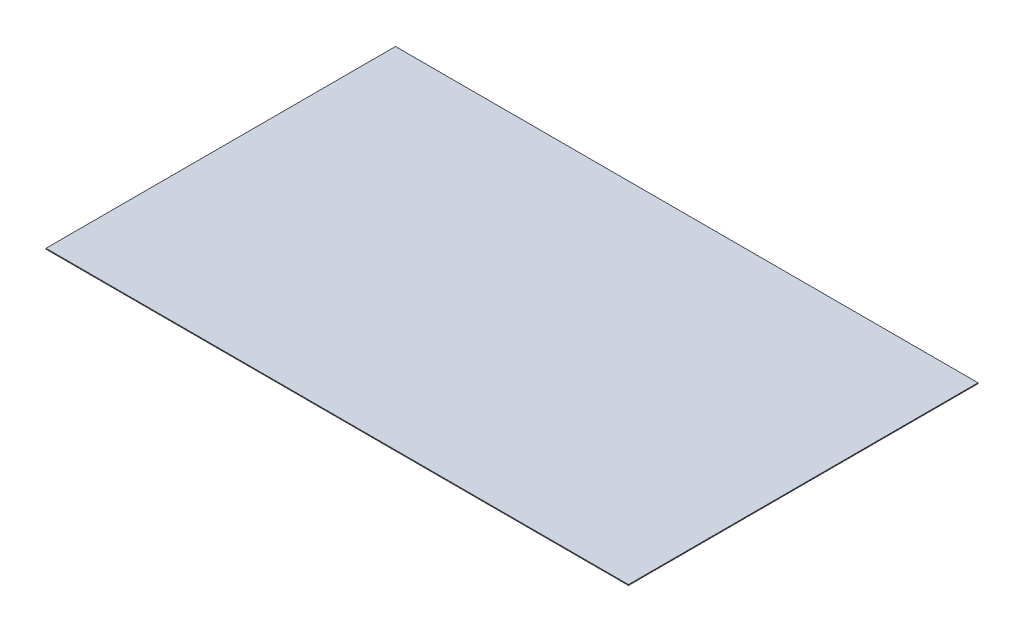
ISO-10303-21;
HEADER;
FILE_DESCRIPTION(('STEP AP214'),'2;1');
FILE_NAME('part.step','',(''),(''),'','','');
FILE_SCHEMA(('AUTOMOTIVE_DESIGN { 1 0 10303 214 1 1 1 1 }'));
ENDSEC;
DATA;
#1=APPLICATION_CONTEXT('core data for automotive mechanical design processes');
#2=APPLICATION_PROTOCOL_DEFINITION('international standard','automotive_design',2000,#1);
#3=PRODUCT_CONTEXT('',#1,'mechanical');
#4=PRODUCT('Part','Part','',(#3));
#5=PRODUCT_RELATED_PRODUCT_CATEGORY('part','',(#4));
#6=PRODUCT_DEFINITION_FORMATION('','',#4);
#7=PRODUCT_DEFINITION_CONTEXT('part definition',#1,'design');
#8=PRODUCT_DEFINITION('design','',#6,#7);
#9=PRODUCT_DEFINITION_SHAPE('','',#8);
#10=(LENGTH_UNIT() NAMED_UNIT(*) SI_UNIT(.MILLI.,.METRE.));
#11=(NAMED_UNIT(*) PLANE_ANGLE_UNIT() SI_UNIT($,.RADIAN.));
#12=(NAMED_UNIT(*) SI_UNIT($,.STERADIAN.) SOLID_ANGLE_UNIT());
#13=UNCERTAINTY_MEASURE_WITH_UNIT(LENGTH_MEASURE(1.E-05),#10,'distance_accuracy_value','');
#14=(GEOMETRIC_REPRESENTATION_CONTEXT(3) GLOBAL_UNCERTAINTY_ASSIGNED_CONTEXT((#13)) GLOBAL_UNIT_ASSIGNED_CONTEXT((#10,
#11,#12)) REPRESENTATION_CONTEXT('',''));
#15=CARTESIAN_POINT('',(0.,0.,0.));
#16=DIRECTION('',(0.,0.,1.));
#17=DIRECTION('',(1.,0.,0.));
#18=AXIS2_PLACEMENT_3D('',#15,#16,#17);
#19=CARTESIAN_POINT('',(0.,0.035,0.));
#20=DIRECTION('',(1.,0.,0.));
#21=DIRECTION('',(0.,0.,-1.));
#22=AXIS2_PLACEMENT_3D('',#19,#20,#21);
#23=PLANE('',#22);
#24=DIRECTION('',(0.,0.,1.));
#25=VECTOR('',#24,1.);
#26=CARTESIAN_POINT('',(0.,0.,0.));
#27=LINE('',#26,#25);
#28=CARTESIAN_POINT('',(0.,0.,-15.));
#29=VERTEX_POINT('',#28);
#30=CARTESIAN_POINT('',(0.,0.,0.));
#31=VERTEX_POINT('',#30);
#32=EDGE_CURVE('E98',#29,#31,#27,.T.);
#33=ORIENTED_EDGE('',*,*,#32,.T.);
#34=DIRECTION('',(0.,-1.,0.));
#35=VECTOR('',#34,1.);
#36=CARTESIAN_POINT('',(0.,0.035,0.));
#37=LINE('',#36,#35);
#38=CARTESIAN_POINT('',(0.,0.035,0.));
#39=VERTEX_POINT('',#38);
#40=EDGE_CURVE('E11',#39,#31,#37,.T.);
#41=ORIENTED_EDGE('',*,*,#40,.F.);
#42=DIRECTION('',(0.,0.,1.));
#43=VECTOR('',#42,1.);
#44=CARTESIAN_POINT('',(0.,0.035,0.));
#45=LINE('',#44,#43);
#46=CARTESIAN_POINT('',(0.,0.035,-15.));
#47=VERTEX_POINT('',#46);
#48=EDGE_CURVE('E86',#47,#39,#45,.T.);
#49=ORIENTED_EDGE('',*,*,#48,.F.);
#50=DIRECTION('',(0.,-1.,0.));
#51=VECTOR('',#50,1.);
#52=CARTESIAN_POINT('',(0.,0.035,-15.));
#53=LINE('',#52,#51);
#54=EDGE_CURVE('E94',#47,#29,#53,.T.);
#55=ORIENTED_EDGE('',*,*,#54,.T.);
#56=EDGE_LOOP('',(#33,#41,#49,#55));
#57=FACE_BOUND('',#56,.T.);
#58=ADVANCED_FACE('F35',(#57),#23,.F.);
#59=CARTESIAN_POINT('',(0.,0.035,0.));
#60=DIRECTION('',(0.,0.,-1.));
#61=DIRECTION('',(-1.,0.,0.));
#62=AXIS2_PLACEMENT_3D('',#59,#60,#61);
#63=PLANE('',#62);
#64=DIRECTION('',(1.,0.,0.));
#65=VECTOR('',#64,1.);
#66=CARTESIAN_POINT('',(0.,0.,0.));
#67=LINE('',#66,#65);
#68=CARTESIAN_POINT('',(25.,0.,0.));
#69=VERTEX_POINT('',#68);
#70=EDGE_CURVE('E90',#31,#69,#67,.T.);
#71=ORIENTED_EDGE('',*,*,#70,.T.);
#72=DIRECTION('',(0.,-1.,0.));
#73=VECTOR('',#72,1.);
#74=CARTESIAN_POINT('',(25.,0.035,0.));
#75=LINE('',#74,#73);
#76=CARTESIAN_POINT('',(25.,0.035,0.));
#77=VERTEX_POINT('',#76);
#78=EDGE_CURVE('E43',#77,#69,#75,.T.);
#79=ORIENTED_EDGE('',*,*,#78,.F.);
#80=DIRECTION('',(1.,0.,0.));
#81=VECTOR('',#80,1.);
#82=CARTESIAN_POINT('',(0.,0.035,0.));
#83=LINE('',#82,#81);
#84=EDGE_CURVE('E81',#39,#77,#83,.T.);
#85=ORIENTED_EDGE('',*,*,#84,.F.);
#86=ORIENTED_EDGE('',*,*,#40,.T.);
#87=EDGE_LOOP('',(#71,#79,#85,#86));
#88=FACE_BOUND('',#87,.T.);
#89=ADVANCED_FACE('F89',(#88),#63,.F.);
#90=CARTESIAN_POINT('',(25.,0.035,0.));
#91=DIRECTION('',(-1.,0.,0.));
#92=DIRECTION('',(0.,0.,1.));
#93=AXIS2_PLACEMENT_3D('',#90,#91,#92);
#94=PLANE('',#93);
#95=DIRECTION('',(0.,0.,-1.));
#96=VECTOR('',#95,1.);
#97=CARTESIAN_POINT('',(25.,0.,0.));
#98=LINE('',#97,#96);
#99=CARTESIAN_POINT('',(25.,0.,-15.));
#100=VERTEX_POINT('',#99);
#101=EDGE_CURVE('E68',#69,#100,#98,.T.);
#102=ORIENTED_EDGE('',*,*,#101,.T.);
#103=DIRECTION('',(0.,-1.,0.));
#104=VECTOR('',#103,1.);
#105=CARTESIAN_POINT('',(25.,0.035,-15.));
#106=LINE('',#105,#104);
#107=CARTESIAN_POINT('',(25.,0.035,-15.));
#108=VERTEX_POINT('',#107);
#109=EDGE_CURVE('E91',#108,#100,#106,.T.);
#110=ORIENTED_EDGE('',*,*,#109,.F.);
#111=DIRECTION('',(0.,0.,-1.));
#112=VECTOR('',#111,1.);
#113=CARTESIAN_POINT('',(25.,0.035,0.));
#114=LINE('',#113,#112);
#115=EDGE_CURVE('E84',#77,#108,#114,.T.);
#116=ORIENTED_EDGE('',*,*,#115,.F.);
#117=ORIENTED_EDGE('',*,*,#78,.T.);
#118=EDGE_LOOP('',(#102,#110,#116,#117));
#119=FACE_BOUND('',#118,.T.);
#120=ADVANCED_FACE('F92',(#119),#94,.F.);
#121=CARTESIAN_POINT('',(0.,0.035,-15.));
#122=DIRECTION('',(0.,0.,1.));
#123=DIRECTION('',(1.,0.,0.));
#124=AXIS2_PLACEMENT_3D('',#121,#122,#123);
#125=PLANE('',#124);
#126=DIRECTION('',(-1.,0.,0.));
#127=VECTOR('',#126,1.);
#128=CARTESIAN_POINT('',(0.,0.,-15.));
#129=LINE('',#128,#127);
#130=EDGE_CURVE('E74',#100,#29,#129,.T.);
#131=ORIENTED_EDGE('',*,*,#130,.T.);
#132=ORIENTED_EDGE('',*,*,#54,.F.);
#133=DIRECTION('',(-1.,0.,0.));
#134=VECTOR('',#133,1.);
#135=CARTESIAN_POINT('',(0.,0.035,-15.));
#136=LINE('',#135,#134);
#137=EDGE_CURVE('E51',#108,#47,#136,.T.);
#138=ORIENTED_EDGE('',*,*,#137,.F.);
#139=ORIENTED_EDGE('',*,*,#109,.T.);
#140=EDGE_LOOP('',(#131,#132,#138,#139));
#141=FACE_BOUND('',#140,.T.);
#142=ADVANCED_FACE('F105',(#141),#125,.F.);
#143=CARTESIAN_POINT('',(0.,0.035,0.));
#144=DIRECTION('',(0.,-1.,0.));
#145=DIRECTION('',(0.,0.,-1.));
#146=AXIS2_PLACEMENT_3D('',#143,#144,#145);
#147=PLANE('',#146);
#148=ORIENTED_EDGE('',*,*,#48,.T.);
#149=ORIENTED_EDGE('',*,*,#84,.T.);
#150=ORIENTED_EDGE('',*,*,#115,.T.);
#151=ORIENTED_EDGE('',*,*,#137,.T.);
#152=EDGE_LOOP('',(#148,#149,#150,#151));
#153=FACE_BOUND('',#152,.T.);
#154=ADVANCED_FACE('F82',(#153),#147,.F.);
#155=CARTESIAN_POINT('',(0.,0.,0.));
#156=DIRECTION('',(0.,-1.,0.));
#157=DIRECTION('',(0.,0.,-1.));
#158=AXIS2_PLACEMENT_3D('',#155,#156,#157);
#159=PLANE('',#158);
#160=ORIENTED_EDGE('',*,*,#32,.F.);
#161=ORIENTED_EDGE('',*,*,#130,.F.);
#162=ORIENTED_EDGE('',*,*,#101,.F.);
#163=ORIENTED_EDGE('',*,*,#70,.F.);
#164=EDGE_LOOP('',(#160,#161,#162,#163));
#165=FACE_BOUND('',#164,.T.);
#166=ADVANCED_FACE('F108',(#165),#159,.T.);
#167=CLOSED_SHELL('',(#58,#89,#120,#142,#154,#166));
#168=MANIFOLD_SOLID_BREP('B2',#167);
#169=ADVANCED_BREP_SHAPE_REPRESENTATION('',(#18,#168),#14);
#170=SHAPE_DEFINITION_REPRESENTATION(#9,#169);
ENDSEC;
END-ISO-10303-21;
